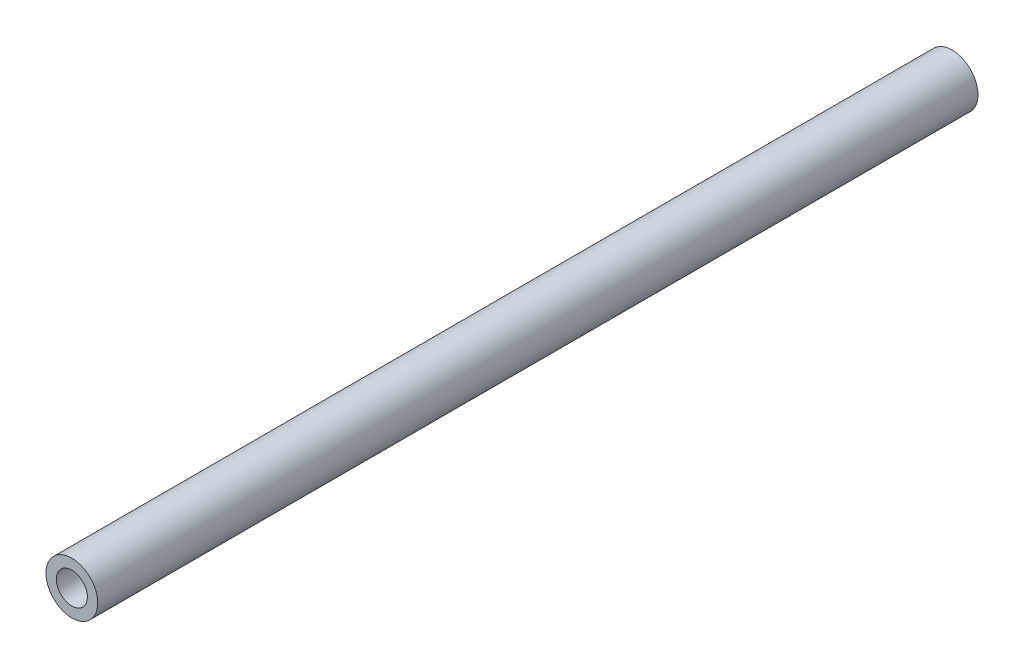
ISO-10303-21;
HEADER;
FILE_DESCRIPTION(('STEP AP214'),'2;1');
FILE_NAME('part.step','',(''),(''),'','','');
FILE_SCHEMA(('AUTOMOTIVE_DESIGN { 1 0 10303 214 1 1 1 1 }'));
ENDSEC;
DATA;
#1=APPLICATION_CONTEXT('core data for automotive mechanical design processes');
#2=APPLICATION_PROTOCOL_DEFINITION('international standard','automotive_design',2000,#1);
#3=PRODUCT_CONTEXT('',#1,'mechanical');
#4=PRODUCT('Part','Part','',(#3));
#5=PRODUCT_RELATED_PRODUCT_CATEGORY('part','',(#4));
#6=PRODUCT_DEFINITION_FORMATION('','',#4);
#7=PRODUCT_DEFINITION_CONTEXT('part definition',#1,'design');
#8=PRODUCT_DEFINITION('design','',#6,#7);
#9=PRODUCT_DEFINITION_SHAPE('','',#8);
#10=(LENGTH_UNIT() NAMED_UNIT(*) SI_UNIT(.MILLI.,.METRE.));
#11=(NAMED_UNIT(*) PLANE_ANGLE_UNIT() SI_UNIT($,.RADIAN.));
#12=(NAMED_UNIT(*) SI_UNIT($,.STERADIAN.) SOLID_ANGLE_UNIT());
#13=UNCERTAINTY_MEASURE_WITH_UNIT(LENGTH_MEASURE(1.E-05),#10,'distance_accuracy_value','');
#14=(GEOMETRIC_REPRESENTATION_CONTEXT(3) GLOBAL_UNCERTAINTY_ASSIGNED_CONTEXT((#13)) GLOBAL_UNIT_ASSIGNED_CONTEXT((#10,
#11,#12)) REPRESENTATION_CONTEXT('',''));
#15=CARTESIAN_POINT('',(0.,0.,0.));
#16=DIRECTION('',(0.,0.,1.));
#17=DIRECTION('',(1.,0.,0.));
#18=AXIS2_PLACEMENT_3D('',#15,#16,#17);
#19=CARTESIAN_POINT('',(0.,0.,170.));
#20=DIRECTION('',(0.,0.,1.));
#21=DIRECTION('',(1.,0.,0.));
#22=AXIS2_PLACEMENT_3D('',#19,#20,#21);
#23=PLANE('',#22);
#24=CARTESIAN_POINT('',(0.,0.,170.));
#25=DIRECTION('',(0.,0.,1.));
#26=DIRECTION('',(1.,0.,0.));
#27=AXIS2_PLACEMENT_3D('',#24,#25,#26);
#28=CIRCLE('',#27,5.);
#29=CARTESIAN_POINT('',(5.,0.,170.));
#30=VERTEX_POINT('',#29);
#31=EDGE_CURVE('E10',#30,#30,#28,.T.);
#32=ORIENTED_EDGE('',*,*,#31,.T.);
#33=EDGE_LOOP('',(#32));
#34=FACE_BOUND('',#33,.T.);
#35=CARTESIAN_POINT('',(0.,0.,170.));
#36=DIRECTION('',(0.,0.,1.));
#37=DIRECTION('',(1.,0.,0.));
#38=AXIS2_PLACEMENT_3D('',#35,#36,#37);
#39=CIRCLE('',#38,3.);
#40=CARTESIAN_POINT('',(3.,0.,170.));
#41=VERTEX_POINT('',#40);
#42=EDGE_CURVE('E44',#41,#41,#39,.T.);
#43=ORIENTED_EDGE('',*,*,#42,.F.);
#44=EDGE_LOOP('',(#43));
#45=FACE_BOUND('',#44,.T.);
#46=ADVANCED_FACE('F33',(#34,#45),#23,.T.);
#47=CARTESIAN_POINT('',(0.,0.,0.));
#48=DIRECTION('',(0.,0.,1.));
#49=DIRECTION('',(1.,0.,0.));
#50=AXIS2_PLACEMENT_3D('',#47,#48,#49);
#51=PLANE('',#50);
#52=CARTESIAN_POINT('',(0.,0.,0.));
#53=DIRECTION('',(0.,0.,1.));
#54=DIRECTION('',(1.,0.,0.));
#55=AXIS2_PLACEMENT_3D('',#52,#53,#54);
#56=CIRCLE('',#55,5.);
#57=CARTESIAN_POINT('',(5.,0.,0.));
#58=VERTEX_POINT('',#57);
#59=EDGE_CURVE('E37',#58,#58,#56,.T.);
#60=ORIENTED_EDGE('',*,*,#59,.F.);
#61=EDGE_LOOP('',(#60));
#62=FACE_BOUND('',#61,.T.);
#63=CARTESIAN_POINT('',(0.,0.,0.));
#64=DIRECTION('',(0.,0.,1.));
#65=DIRECTION('',(1.,0.,0.));
#66=AXIS2_PLACEMENT_3D('',#63,#64,#65);
#67=CIRCLE('',#66,3.);
#68=CARTESIAN_POINT('',(3.,0.,0.));
#69=VERTEX_POINT('',#68);
#70=EDGE_CURVE('E46',#69,#69,#67,.T.);
#71=ORIENTED_EDGE('',*,*,#70,.T.);
#72=EDGE_LOOP('',(#71));
#73=FACE_BOUND('',#72,.T.);
#74=ADVANCED_FACE('F56',(#62,#73),#51,.F.);
#75=CARTESIAN_POINT('',(0.,0.,170.));
#76=DIRECTION('',(0.,0.,-1.));
#77=DIRECTION('',(-1.,0.,0.));
#78=AXIS2_PLACEMENT_3D('',#75,#76,#77);
#79=CYLINDRICAL_SURFACE('',#78,5.);
#80=ORIENTED_EDGE('',*,*,#31,.F.);
#81=EDGE_LOOP('',(#80));
#82=FACE_BOUND('',#81,.T.);
#83=ORIENTED_EDGE('',*,*,#59,.T.);
#84=EDGE_LOOP('',(#83));
#85=FACE_BOUND('',#84,.T.);
#86=ADVANCED_FACE('F35',(#82,#85),#79,.T.);
#87=CARTESIAN_POINT('',(0.,0.,170.));
#88=DIRECTION('',(0.,0.,-1.));
#89=DIRECTION('',(-1.,0.,0.));
#90=AXIS2_PLACEMENT_3D('',#87,#88,#89);
#91=CYLINDRICAL_SURFACE('',#90,3.);
#92=ORIENTED_EDGE('',*,*,#42,.T.);
#93=EDGE_LOOP('',(#92));
#94=FACE_BOUND('',#93,.T.);
#95=ORIENTED_EDGE('',*,*,#70,.F.);
#96=EDGE_LOOP('',(#95));
#97=FACE_BOUND('',#96,.T.);
#98=ADVANCED_FACE('F52',(#94,#97),#91,.F.);
#99=CLOSED_SHELL('',(#46,#74,#86,#98));
#100=MANIFOLD_SOLID_BREP('B2',#99);
#101=ADVANCED_BREP_SHAPE_REPRESENTATION('',(#18,#100),#14);
#102=SHAPE_DEFINITION_REPRESENTATION(#9,#101);
ENDSEC;
END-ISO-10303-21;
